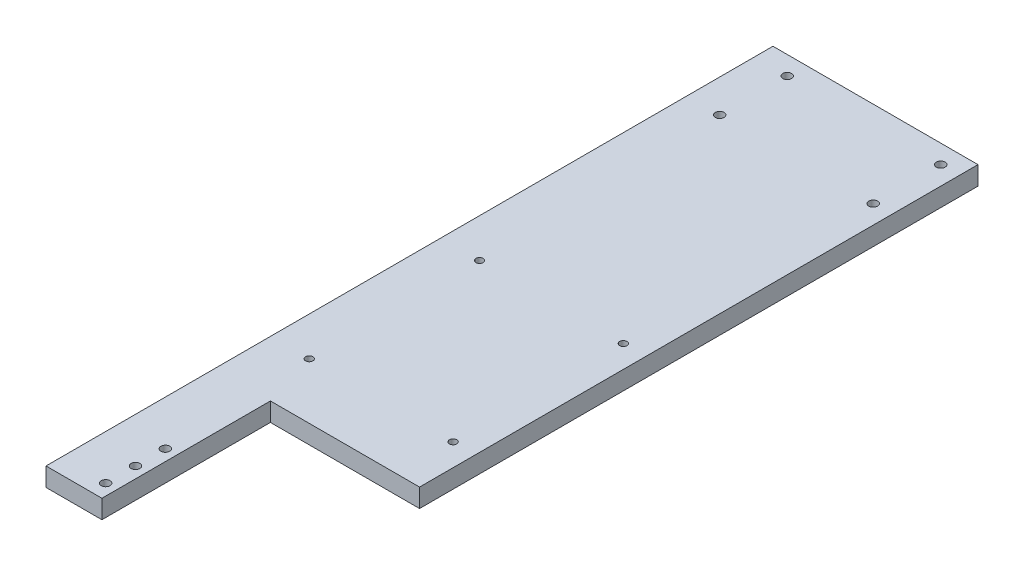
ISO-10303-21;
HEADER;
FILE_DESCRIPTION(('STEP AP214'),'2;1');
FILE_NAME('part.step','',(''),(''),'','','');
FILE_SCHEMA(('AUTOMOTIVE_DESIGN { 1 0 10303 214 1 1 1 1 }'));
ENDSEC;
DATA;
#1=APPLICATION_CONTEXT('core data for automotive mechanical design processes');
#2=APPLICATION_PROTOCOL_DEFINITION('international standard','automotive_design',2000,#1);
#3=PRODUCT_CONTEXT('',#1,'mechanical');
#4=PRODUCT('Part','Part','',(#3));
#5=PRODUCT_RELATED_PRODUCT_CATEGORY('part','',(#4));
#6=PRODUCT_DEFINITION_FORMATION('','',#4);
#7=PRODUCT_DEFINITION_CONTEXT('part definition',#1,'design');
#8=PRODUCT_DEFINITION('design','',#6,#7);
#9=PRODUCT_DEFINITION_SHAPE('','',#8);
#10=(LENGTH_UNIT() NAMED_UNIT(*) SI_UNIT(.MILLI.,.METRE.));
#11=(NAMED_UNIT(*) PLANE_ANGLE_UNIT() SI_UNIT($,.RADIAN.));
#12=(NAMED_UNIT(*) SI_UNIT($,.STERADIAN.) SOLID_ANGLE_UNIT());
#13=UNCERTAINTY_MEASURE_WITH_UNIT(LENGTH_MEASURE(1.E-05),#10,'distance_accuracy_value','');
#14=(GEOMETRIC_REPRESENTATION_CONTEXT(3) GLOBAL_UNCERTAINTY_ASSIGNED_CONTEXT((#13)) GLOBAL_UNIT_ASSIGNED_CONTEXT((#10,
#11,#12)) REPRESENTATION_CONTEXT('',''));
#15=CARTESIAN_POINT('',(0.,0.,0.));
#16=DIRECTION('',(0.,0.,1.));
#17=DIRECTION('',(1.,0.,0.));
#18=AXIS2_PLACEMENT_3D('',#15,#16,#17);
#19=CARTESIAN_POINT('',(0.,6.35,0.));
#20=DIRECTION('',(1.,0.,0.));
#21=DIRECTION('',(0.,0.,-1.));
#22=AXIS2_PLACEMENT_3D('',#19,#20,#21);
#23=PLANE('',#22);
#24=DIRECTION('',(0.,0.,1.));
#25=VECTOR('',#24,1.);
#26=CARTESIAN_POINT('',(0.,0.,0.));
#27=LINE('',#26,#25);
#28=CARTESIAN_POINT('',(0.,0.,-247.65));
#29=VERTEX_POINT('',#28);
#30=CARTESIAN_POINT('',(0.,0.,0.));
#31=VERTEX_POINT('',#30);
#32=EDGE_CURVE('E119',#29,#31,#27,.T.);
#33=ORIENTED_EDGE('',*,*,#32,.T.);
#34=DIRECTION('',(0.,-1.,0.));
#35=VECTOR('',#34,1.);
#36=CARTESIAN_POINT('',(0.,6.35,0.));
#37=LINE('',#36,#35);
#38=CARTESIAN_POINT('',(0.,6.35,0.));
#39=VERTEX_POINT('',#38);
#40=EDGE_CURVE('E11',#39,#31,#37,.T.);
#41=ORIENTED_EDGE('',*,*,#40,.F.);
#42=DIRECTION('',(0.,0.,1.));
#43=VECTOR('',#42,1.);
#44=CARTESIAN_POINT('',(0.,6.35,0.));
#45=LINE('',#44,#43);
#46=CARTESIAN_POINT('',(0.,6.35,-247.65));
#47=VERTEX_POINT('',#46);
#48=EDGE_CURVE('E116',#47,#39,#45,.T.);
#49=ORIENTED_EDGE('',*,*,#48,.F.);
#50=DIRECTION('',(0.,-1.,0.));
#51=VECTOR('',#50,1.);
#52=CARTESIAN_POINT('',(0.,6.35,-247.65));
#53=LINE('',#52,#51);
#54=EDGE_CURVE('E123',#47,#29,#53,.T.);
#55=ORIENTED_EDGE('',*,*,#54,.T.);
#56=EDGE_LOOP('',(#33,#41,#49,#55));
#57=FACE_BOUND('',#56,.T.);
#58=ADVANCED_FACE('F33',(#57),#23,.F.);
#59=CARTESIAN_POINT('',(0.,6.35,0.));
#60=DIRECTION('',(0.,0.,-1.));
#61=DIRECTION('',(-1.,0.,0.));
#62=AXIS2_PLACEMENT_3D('',#59,#60,#61);
#63=PLANE('',#62);
#64=DIRECTION('',(1.,0.,0.));
#65=VECTOR('',#64,1.);
#66=CARTESIAN_POINT('',(0.,0.,0.));
#67=LINE('',#66,#65);
#68=CARTESIAN_POINT('',(19.05,0.,0.));
#69=VERTEX_POINT('',#68);
#70=EDGE_CURVE('E114',#31,#69,#67,.T.);
#71=ORIENTED_EDGE('',*,*,#70,.T.);
#72=DIRECTION('',(0.,1.,0.));
#73=VECTOR('',#72,1.);
#74=CARTESIAN_POINT('',(19.05,0.,0.));
#75=LINE('',#74,#73);
#76=CARTESIAN_POINT('',(19.05,6.35,0.));
#77=VERTEX_POINT('',#76);
#78=EDGE_CURVE('E130',#69,#77,#75,.T.);
#79=ORIENTED_EDGE('',*,*,#78,.T.);
#80=DIRECTION('',(1.,0.,0.));
#81=VECTOR('',#80,1.);
#82=CARTESIAN_POINT('',(0.,6.35,0.));
#83=LINE('',#82,#81);
#84=EDGE_CURVE('E79',#39,#77,#83,.T.);
#85=ORIENTED_EDGE('',*,*,#84,.F.);
#86=ORIENTED_EDGE('',*,*,#40,.T.);
#87=EDGE_LOOP('',(#71,#79,#85,#86));
#88=FACE_BOUND('',#87,.T.);
#89=ADVANCED_FACE('F140',(#88),#63,.F.);
#90=CARTESIAN_POINT('',(69.85,6.35,0.));
#91=DIRECTION('',(-1.,0.,0.));
#92=DIRECTION('',(0.,0.,1.));
#93=AXIS2_PLACEMENT_3D('',#90,#91,#92);
#94=PLANE('',#93);
#95=DIRECTION('',(0.,0.,-1.));
#96=VECTOR('',#95,1.);
#97=CARTESIAN_POINT('',(69.85,6.35,0.));
#98=LINE('',#97,#96);
#99=CARTESIAN_POINT('',(69.85,6.35,-57.404));
#100=VERTEX_POINT('',#99);
#101=CARTESIAN_POINT('',(69.85,6.35,-247.65));
#102=VERTEX_POINT('',#101);
#103=EDGE_CURVE('E110',#100,#102,#98,.T.);
#104=ORIENTED_EDGE('',*,*,#103,.F.);
#105=DIRECTION('',(0.,1.,0.));
#106=VECTOR('',#105,1.);
#107=CARTESIAN_POINT('',(69.85,0.,-57.404));
#108=LINE('',#107,#106);
#109=CARTESIAN_POINT('',(69.85,0.,-57.404));
#110=VERTEX_POINT('',#109);
#111=EDGE_CURVE('E98',#110,#100,#108,.T.);
#112=ORIENTED_EDGE('',*,*,#111,.F.);
#113=DIRECTION('',(0.,0.,-1.));
#114=VECTOR('',#113,1.);
#115=CARTESIAN_POINT('',(69.85,0.,0.));
#116=LINE('',#115,#114);
#117=CARTESIAN_POINT('',(69.85,0.,-247.65));
#118=VERTEX_POINT('',#117);
#119=EDGE_CURVE('E109',#110,#118,#116,.T.);
#120=ORIENTED_EDGE('',*,*,#119,.T.);
#121=DIRECTION('',(0.,-1.,0.));
#122=VECTOR('',#121,1.);
#123=CARTESIAN_POINT('',(69.85,6.35,-247.65));
#124=LINE('',#123,#122);
#125=EDGE_CURVE('E40',#102,#118,#124,.T.);
#126=ORIENTED_EDGE('',*,*,#125,.F.);
#127=EDGE_LOOP('',(#104,#112,#120,#126));
#128=FACE_BOUND('',#127,.T.);
#129=ADVANCED_FACE('F107',(#128),#94,.F.);
#130=CARTESIAN_POINT('',(0.,6.35,-247.65));
#131=DIRECTION('',(0.,0.,1.));
#132=DIRECTION('',(1.,0.,0.));
#133=AXIS2_PLACEMENT_3D('',#130,#131,#132);
#134=PLANE('',#133);
#135=DIRECTION('',(-1.,0.,0.));
#136=VECTOR('',#135,1.);
#137=CARTESIAN_POINT('',(0.,0.,-247.65));
#138=LINE('',#137,#136);
#139=EDGE_CURVE('E73',#118,#29,#138,.T.);
#140=ORIENTED_EDGE('',*,*,#139,.T.);
#141=ORIENTED_EDGE('',*,*,#54,.F.);
#142=DIRECTION('',(-1.,0.,0.));
#143=VECTOR('',#142,1.);
#144=CARTESIAN_POINT('',(0.,6.35,-247.65));
#145=LINE('',#144,#143);
#146=EDGE_CURVE('E56',#102,#47,#145,.T.);
#147=ORIENTED_EDGE('',*,*,#146,.F.);
#148=ORIENTED_EDGE('',*,*,#125,.T.);
#149=EDGE_LOOP('',(#140,#141,#147,#148));
#150=FACE_BOUND('',#149,.T.);
#151=ADVANCED_FACE('F124',(#150),#134,.F.);
#152=CARTESIAN_POINT('',(0.,6.35,0.));
#153=DIRECTION('',(0.,-1.,0.));
#154=DIRECTION('',(0.,0.,-1.));
#155=AXIS2_PLACEMENT_3D('',#152,#153,#154);
#156=PLANE('',#155);
#157=CARTESIAN_POINT('',(13.23,6.35,-134.454));
#158=DIRECTION('',(0.,1.,0.));
#159=DIRECTION('',(0.,0.,1.));
#160=AXIS2_PLACEMENT_3D('',#157,#158,#159);
#161=CIRCLE('',#160,1.25);
#162=CARTESIAN_POINT('',(13.23,6.35,-133.204));
#163=VERTEX_POINT('',#162);
#164=EDGE_CURVE('E206',#163,#163,#161,.T.);
#165=ORIENTED_EDGE('',*,*,#164,.F.);
#166=EDGE_LOOP('',(#165));
#167=FACE_BOUND('',#166,.T.);
#168=CARTESIAN_POINT('',(62.23,6.35,-76.454));
#169=DIRECTION('',(0.,1.,0.));
#170=DIRECTION('',(0.,0.,1.));
#171=AXIS2_PLACEMENT_3D('',#168,#169,#170);
#172=CIRCLE('',#171,1.24999999999999);
#173=CARTESIAN_POINT('',(62.23,6.35,-75.204));
#174=VERTEX_POINT('',#173);
#175=EDGE_CURVE('E199',#174,#174,#172,.T.);
#176=ORIENTED_EDGE('',*,*,#175,.F.);
#177=EDGE_LOOP('',(#176));
#178=FACE_BOUND('',#177,.T.);
#179=CARTESIAN_POINT('',(13.23,6.35,-76.454));
#180=DIRECTION('',(0.,1.,0.));
#181=DIRECTION('',(0.,0.,1.));
#182=AXIS2_PLACEMENT_3D('',#179,#180,#181);
#183=CIRCLE('',#182,1.25);
#184=CARTESIAN_POINT('',(13.23,6.35,-75.204));
#185=VERTEX_POINT('',#184);
#186=EDGE_CURVE('E211',#185,#185,#183,.T.);
#187=ORIENTED_EDGE('',*,*,#186,.F.);
#188=EDGE_LOOP('',(#187));
#189=FACE_BOUND('',#188,.T.);
#190=CARTESIAN_POINT('',(62.23,6.35,-134.454));
#191=DIRECTION('',(0.,1.,0.));
#192=DIRECTION('',(0.,0.,1.));
#193=AXIS2_PLACEMENT_3D('',#190,#191,#192);
#194=CIRCLE('',#193,1.24999999999999);
#195=CARTESIAN_POINT('',(62.23,6.35,-133.204));
#196=VERTEX_POINT('',#195);
#197=EDGE_CURVE('E193',#196,#196,#194,.T.);
#198=ORIENTED_EDGE('',*,*,#197,.F.);
#199=EDGE_LOOP('',(#198));
#200=FACE_BOUND('',#199,.T.);
#201=CARTESIAN_POINT('',(11.2,6.35,-241.3));
#202=DIRECTION('',(0.,1.,0.));
#203=DIRECTION('',(0.,0.,1.));
#204=AXIS2_PLACEMENT_3D('',#201,#202,#203);
#205=CIRCLE('',#204,1.499997);
#206=CARTESIAN_POINT('',(11.2,6.35,-239.800003));
#207=VERTEX_POINT('',#206);
#208=EDGE_CURVE('E175',#207,#207,#205,.T.);
#209=ORIENTED_EDGE('',*,*,#208,.F.);
#210=EDGE_LOOP('',(#209));
#211=FACE_BOUND('',#210,.T.);
#212=CARTESIAN_POINT('',(11.2,6.35,-218.3));
#213=DIRECTION('',(0.,1.,0.));
#214=DIRECTION('',(0.,0.,1.));
#215=AXIS2_PLACEMENT_3D('',#212,#213,#214);
#216=CIRCLE('',#215,1.499997);
#217=CARTESIAN_POINT('',(11.2,6.35,-216.800003));
#218=VERTEX_POINT('',#217);
#219=EDGE_CURVE('E182',#218,#218,#216,.T.);
#220=ORIENTED_EDGE('',*,*,#219,.F.);
#221=EDGE_LOOP('',(#220));
#222=FACE_BOUND('',#221,.T.);
#223=CARTESIAN_POINT('',(63.5,6.35,-218.3));
#224=DIRECTION('',(0.,1.,0.));
#225=DIRECTION('',(0.,0.,1.));
#226=AXIS2_PLACEMENT_3D('',#223,#224,#225);
#227=CIRCLE('',#226,1.49999700000001);
#228=CARTESIAN_POINT('',(63.5,6.35,-216.800003));
#229=VERTEX_POINT('',#228);
#230=EDGE_CURVE('E188',#229,#229,#227,.T.);
#231=ORIENTED_EDGE('',*,*,#230,.F.);
#232=EDGE_LOOP('',(#231));
#233=FACE_BOUND('',#232,.T.);
#234=CARTESIAN_POINT('',(63.5,6.35,-241.3));
#235=DIRECTION('',(0.,1.,0.));
#236=DIRECTION('',(0.,0.,1.));
#237=AXIS2_PLACEMENT_3D('',#234,#235,#236);
#238=CIRCLE('',#237,1.49999700000001);
#239=CARTESIAN_POINT('',(63.5,6.35,-239.800003));
#240=VERTEX_POINT('',#239);
#241=EDGE_CURVE('E154',#240,#240,#238,.T.);
#242=ORIENTED_EDGE('',*,*,#241,.F.);
#243=EDGE_LOOP('',(#242));
#244=FACE_BOUND('',#243,.T.);
#245=CARTESIAN_POINT('',(15.24,6.35,-5.08));
#246=DIRECTION('',(0.,1.,0.));
#247=DIRECTION('',(0.,0.,1.));
#248=AXIS2_PLACEMENT_3D('',#245,#246,#247);
#249=CIRCLE('',#248,1.499997);
#250=CARTESIAN_POINT('',(15.24,6.35,-3.580003));
#251=VERTEX_POINT('',#250);
#252=EDGE_CURVE('E146',#251,#251,#249,.T.);
#253=ORIENTED_EDGE('',*,*,#252,.F.);
#254=EDGE_LOOP('',(#253));
#255=FACE_BOUND('',#254,.T.);
#256=CARTESIAN_POINT('',(15.24,6.35,-25.4));
#257=DIRECTION('',(0.,1.,0.));
#258=DIRECTION('',(0.,0.,1.));
#259=AXIS2_PLACEMENT_3D('',#256,#257,#258);
#260=CIRCLE('',#259,1.499997);
#261=CARTESIAN_POINT('',(15.24,6.35,-23.900003));
#262=VERTEX_POINT('',#261);
#263=EDGE_CURVE('E159',#262,#262,#260,.T.);
#264=ORIENTED_EDGE('',*,*,#263,.F.);
#265=EDGE_LOOP('',(#264));
#266=FACE_BOUND('',#265,.T.);
#267=CARTESIAN_POINT('',(15.24,6.35,-15.24));
#268=DIRECTION('',(0.,1.,0.));
#269=DIRECTION('',(0.,0.,1.));
#270=AXIS2_PLACEMENT_3D('',#267,#268,#269);
#271=CIRCLE('',#270,1.499997);
#272=CARTESIAN_POINT('',(15.24,6.35,-13.740003));
#273=VERTEX_POINT('',#272);
#274=EDGE_CURVE('E164',#273,#273,#271,.T.);
#275=ORIENTED_EDGE('',*,*,#274,.F.);
#276=EDGE_LOOP('',(#275));
#277=FACE_BOUND('',#276,.T.);
#278=ORIENTED_EDGE('',*,*,#84,.T.);
#279=DIRECTION('',(0.,0.,1.));
#280=VECTOR('',#279,1.);
#281=CARTESIAN_POINT('',(19.05,6.35,0.));
#282=LINE('',#281,#280);
#283=CARTESIAN_POINT('',(19.05,6.35,-57.404));
#284=VERTEX_POINT('',#283);
#285=EDGE_CURVE('E103',#284,#77,#282,.T.);
#286=ORIENTED_EDGE('',*,*,#285,.F.);
#287=DIRECTION('',(-1.,0.,0.));
#288=VECTOR('',#287,1.);
#289=CARTESIAN_POINT('',(69.85,6.35,-57.404));
#290=LINE('',#289,#288);
#291=EDGE_CURVE('E143',#100,#284,#290,.T.);
#292=ORIENTED_EDGE('',*,*,#291,.F.);
#293=ORIENTED_EDGE('',*,*,#103,.T.);
#294=ORIENTED_EDGE('',*,*,#146,.T.);
#295=ORIENTED_EDGE('',*,*,#48,.T.);
#296=EDGE_LOOP('',(#278,#286,#292,#293,#294,#295));
#297=FACE_BOUND('',#296,.T.);
#298=ADVANCED_FACE('F139',(#167,#178,#189,#200,#211,#222,#233,#244,#255,#266,#277,#297),#156,.F.);
#299=CARTESIAN_POINT('',(0.,0.,0.));
#300=DIRECTION('',(0.,-1.,0.));
#301=DIRECTION('',(0.,0.,-1.));
#302=AXIS2_PLACEMENT_3D('',#299,#300,#301);
#303=PLANE('',#302);
#304=CARTESIAN_POINT('',(13.23,0.,-134.454));
#305=DIRECTION('',(0.,1.,0.));
#306=DIRECTION('',(0.,0.,1.));
#307=AXIS2_PLACEMENT_3D('',#304,#305,#306);
#308=CIRCLE('',#307,1.25);
#309=CARTESIAN_POINT('',(13.23,0.,-133.204));
#310=VERTEX_POINT('',#309);
#311=EDGE_CURVE('E196',#310,#310,#308,.T.);
#312=ORIENTED_EDGE('',*,*,#311,.T.);
#313=EDGE_LOOP('',(#312));
#314=FACE_BOUND('',#313,.T.);
#315=CARTESIAN_POINT('',(62.23,0.,-76.454));
#316=DIRECTION('',(0.,1.,0.));
#317=DIRECTION('',(0.,0.,1.));
#318=AXIS2_PLACEMENT_3D('',#315,#316,#317);
#319=CIRCLE('',#318,1.24999999999999);
#320=CARTESIAN_POINT('',(62.23,0.,-75.204));
#321=VERTEX_POINT('',#320);
#322=EDGE_CURVE('E202',#321,#321,#319,.T.);
#323=ORIENTED_EDGE('',*,*,#322,.T.);
#324=EDGE_LOOP('',(#323));
#325=FACE_BOUND('',#324,.T.);
#326=CARTESIAN_POINT('',(13.23,0.,-76.454));
#327=DIRECTION('',(0.,1.,0.));
#328=DIRECTION('',(0.,0.,1.));
#329=AXIS2_PLACEMENT_3D('',#326,#327,#328);
#330=CIRCLE('',#329,1.25);
#331=CARTESIAN_POINT('',(13.23,0.,-75.204));
#332=VERTEX_POINT('',#331);
#333=EDGE_CURVE('E203',#332,#332,#330,.T.);
#334=ORIENTED_EDGE('',*,*,#333,.T.);
#335=EDGE_LOOP('',(#334));
#336=FACE_BOUND('',#335,.T.);
#337=CARTESIAN_POINT('',(62.23,0.,-134.454));
#338=DIRECTION('',(0.,1.,0.));
#339=DIRECTION('',(0.,0.,1.));
#340=AXIS2_PLACEMENT_3D('',#337,#338,#339);
#341=CIRCLE('',#340,1.24999999999999);
#342=CARTESIAN_POINT('',(62.23,0.,-133.204));
#343=VERTEX_POINT('',#342);
#344=EDGE_CURVE('E179',#343,#343,#341,.T.);
#345=ORIENTED_EDGE('',*,*,#344,.T.);
#346=EDGE_LOOP('',(#345));
#347=FACE_BOUND('',#346,.T.);
#348=CARTESIAN_POINT('',(11.2,0.,-241.3));
#349=DIRECTION('',(0.,1.,0.));
#350=DIRECTION('',(0.,0.,1.));
#351=AXIS2_PLACEMENT_3D('',#348,#349,#350);
#352=CIRCLE('',#351,1.499997);
#353=CARTESIAN_POINT('',(11.2,0.,-239.800003));
#354=VERTEX_POINT('',#353);
#355=EDGE_CURVE('E178',#354,#354,#352,.T.);
#356=ORIENTED_EDGE('',*,*,#355,.T.);
#357=EDGE_LOOP('',(#356));
#358=FACE_BOUND('',#357,.T.);
#359=CARTESIAN_POINT('',(11.2,0.,-218.3));
#360=DIRECTION('',(0.,1.,0.));
#361=DIRECTION('',(0.,0.,1.));
#362=AXIS2_PLACEMENT_3D('',#359,#360,#361);
#363=CIRCLE('',#362,1.499997);
#364=CARTESIAN_POINT('',(11.2,0.,-216.800003));
#365=VERTEX_POINT('',#364);
#366=EDGE_CURVE('E185',#365,#365,#363,.T.);
#367=ORIENTED_EDGE('',*,*,#366,.T.);
#368=EDGE_LOOP('',(#367));
#369=FACE_BOUND('',#368,.T.);
#370=CARTESIAN_POINT('',(63.5,0.,-218.3));
#371=DIRECTION('',(0.,1.,0.));
#372=DIRECTION('',(0.,0.,1.));
#373=AXIS2_PLACEMENT_3D('',#370,#371,#372);
#374=CIRCLE('',#373,1.49999700000001);
#375=CARTESIAN_POINT('',(63.5,0.,-216.800003));
#376=VERTEX_POINT('',#375);
#377=EDGE_CURVE('E173',#376,#376,#374,.T.);
#378=ORIENTED_EDGE('',*,*,#377,.T.);
#379=EDGE_LOOP('',(#378));
#380=FACE_BOUND('',#379,.T.);
#381=CARTESIAN_POINT('',(63.5,0.,-241.3));
#382=DIRECTION('',(0.,1.,0.));
#383=DIRECTION('',(0.,0.,1.));
#384=AXIS2_PLACEMENT_3D('',#381,#382,#383);
#385=CIRCLE('',#384,1.49999700000001);
#386=CARTESIAN_POINT('',(63.5,0.,-239.800003));
#387=VERTEX_POINT('',#386);
#388=EDGE_CURVE('E166',#387,#387,#385,.T.);
#389=ORIENTED_EDGE('',*,*,#388,.T.);
#390=EDGE_LOOP('',(#389));
#391=FACE_BOUND('',#390,.T.);
#392=CARTESIAN_POINT('',(15.24,0.,-5.08));
#393=DIRECTION('',(0.,1.,0.));
#394=DIRECTION('',(0.,0.,1.));
#395=AXIS2_PLACEMENT_3D('',#392,#393,#394);
#396=CIRCLE('',#395,1.499997);
#397=CARTESIAN_POINT('',(15.24,0.,-3.580003));
#398=VERTEX_POINT('',#397);
#399=EDGE_CURVE('E144',#398,#398,#396,.T.);
#400=ORIENTED_EDGE('',*,*,#399,.T.);
#401=EDGE_LOOP('',(#400));
#402=FACE_BOUND('',#401,.T.);
#403=CARTESIAN_POINT('',(15.24,0.,-25.4));
#404=DIRECTION('',(0.,1.,0.));
#405=DIRECTION('',(0.,0.,1.));
#406=AXIS2_PLACEMENT_3D('',#403,#404,#405);
#407=CIRCLE('',#406,1.499997);
#408=CARTESIAN_POINT('',(15.24,0.,-23.900003));
#409=VERTEX_POINT('',#408);
#410=EDGE_CURVE('E151',#409,#409,#407,.T.);
#411=ORIENTED_EDGE('',*,*,#410,.T.);
#412=EDGE_LOOP('',(#411));
#413=FACE_BOUND('',#412,.T.);
#414=CARTESIAN_POINT('',(15.24,0.,-15.24));
#415=DIRECTION('',(0.,1.,0.));
#416=DIRECTION('',(0.,0.,1.));
#417=AXIS2_PLACEMENT_3D('',#414,#415,#416);
#418=CIRCLE('',#417,1.499997);
#419=CARTESIAN_POINT('',(15.24,0.,-13.740003));
#420=VERTEX_POINT('',#419);
#421=EDGE_CURVE('E162',#420,#420,#418,.T.);
#422=ORIENTED_EDGE('',*,*,#421,.T.);
#423=EDGE_LOOP('',(#422));
#424=FACE_BOUND('',#423,.T.);
#425=DIRECTION('',(0.,0.,1.));
#426=VECTOR('',#425,1.);
#427=CARTESIAN_POINT('',(19.05,0.,0.));
#428=LINE('',#427,#426);
#429=CARTESIAN_POINT('',(19.05,0.,-57.404));
#430=VERTEX_POINT('',#429);
#431=EDGE_CURVE('E47',#430,#69,#428,.T.);
#432=ORIENTED_EDGE('',*,*,#431,.T.);
#433=ORIENTED_EDGE('',*,*,#70,.F.);
#434=ORIENTED_EDGE('',*,*,#32,.F.);
#435=ORIENTED_EDGE('',*,*,#139,.F.);
#436=ORIENTED_EDGE('',*,*,#119,.F.);
#437=DIRECTION('',(-1.,0.,0.));
#438=VECTOR('',#437,1.);
#439=CARTESIAN_POINT('',(69.85,0.,-57.404));
#440=LINE('',#439,#438);
#441=EDGE_CURVE('E94',#110,#430,#440,.T.);
#442=ORIENTED_EDGE('',*,*,#441,.T.);
#443=EDGE_LOOP('',(#432,#433,#434,#435,#436,#442));
#444=FACE_BOUND('',#443,.T.);
#445=ADVANCED_FACE('F112',(#314,#325,#336,#347,#358,#369,#380,#391,#402,#413,#424,#444),#303,.T.);
#446=CARTESIAN_POINT('',(19.05,0.,0.));
#447=DIRECTION('',(-1.,0.,0.));
#448=DIRECTION('',(0.,0.,1.));
#449=AXIS2_PLACEMENT_3D('',#446,#447,#448);
#450=PLANE('',#449);
#451=ORIENTED_EDGE('',*,*,#285,.T.);
#452=ORIENTED_EDGE('',*,*,#78,.F.);
#453=ORIENTED_EDGE('',*,*,#431,.F.);
#454=DIRECTION('',(0.,1.,0.));
#455=VECTOR('',#454,1.);
#456=CARTESIAN_POINT('',(19.05,0.,-57.404));
#457=LINE('',#456,#455);
#458=EDGE_CURVE('E100',#430,#284,#457,.T.);
#459=ORIENTED_EDGE('',*,*,#458,.T.);
#460=EDGE_LOOP('',(#451,#452,#453,#459));
#461=FACE_BOUND('',#460,.T.);
#462=ADVANCED_FACE('F274',(#461),#450,.F.);
#463=CARTESIAN_POINT('',(69.85,0.,-57.404));
#464=DIRECTION('',(0.,0.,-1.));
#465=DIRECTION('',(-1.,0.,0.));
#466=AXIS2_PLACEMENT_3D('',#463,#464,#465);
#467=PLANE('',#466);
#468=ORIENTED_EDGE('',*,*,#291,.T.);
#469=ORIENTED_EDGE('',*,*,#458,.F.);
#470=ORIENTED_EDGE('',*,*,#441,.F.);
#471=ORIENTED_EDGE('',*,*,#111,.T.);
#472=EDGE_LOOP('',(#468,#469,#470,#471));
#473=FACE_BOUND('',#472,.T.);
#474=ADVANCED_FACE('F97',(#473),#467,.F.);
#475=CARTESIAN_POINT('',(15.24,0.,-15.24));
#476=DIRECTION('',(0.,1.,0.));
#477=DIRECTION('',(0.,0.,1.));
#478=AXIS2_PLACEMENT_3D('',#475,#476,#477);
#479=CYLINDRICAL_SURFACE('',#478,1.499997);
#480=ORIENTED_EDGE('',*,*,#421,.F.);
#481=EDGE_LOOP('',(#480));
#482=FACE_BOUND('',#481,.T.);
#483=ORIENTED_EDGE('',*,*,#274,.T.);
#484=EDGE_LOOP('',(#483));
#485=FACE_BOUND('',#484,.T.);
#486=ADVANCED_FACE('F249',(#482,#485),#479,.F.);
#487=CARTESIAN_POINT('',(15.24,0.,-25.4));
#488=DIRECTION('',(0.,1.,0.));
#489=DIRECTION('',(0.,0.,1.));
#490=AXIS2_PLACEMENT_3D('',#487,#488,#489);
#491=CYLINDRICAL_SURFACE('',#490,1.499997);
#492=ORIENTED_EDGE('',*,*,#410,.F.);
#493=EDGE_LOOP('',(#492));
#494=FACE_BOUND('',#493,.T.);
#495=ORIENTED_EDGE('',*,*,#263,.T.);
#496=EDGE_LOOP('',(#495));
#497=FACE_BOUND('',#496,.T.);
#498=ADVANCED_FACE('F246',(#494,#497),#491,.F.);
#499=CARTESIAN_POINT('',(15.24,0.,-5.08));
#500=DIRECTION('',(0.,1.,0.));
#501=DIRECTION('',(0.,0.,1.));
#502=AXIS2_PLACEMENT_3D('',#499,#500,#501);
#503=CYLINDRICAL_SURFACE('',#502,1.499997);
#504=ORIENTED_EDGE('',*,*,#399,.F.);
#505=EDGE_LOOP('',(#504));
#506=FACE_BOUND('',#505,.T.);
#507=ORIENTED_EDGE('',*,*,#252,.T.);
#508=EDGE_LOOP('',(#507));
#509=FACE_BOUND('',#508,.T.);
#510=ADVANCED_FACE('F248',(#506,#509),#503,.F.);
#511=CARTESIAN_POINT('',(63.5,0.,-241.3));
#512=DIRECTION('',(0.,1.,0.));
#513=DIRECTION('',(0.,0.,1.));
#514=AXIS2_PLACEMENT_3D('',#511,#512,#513);
#515=CYLINDRICAL_SURFACE('',#514,1.49999700000001);
#516=ORIENTED_EDGE('',*,*,#388,.F.);
#517=EDGE_LOOP('',(#516));
#518=FACE_BOUND('',#517,.T.);
#519=ORIENTED_EDGE('',*,*,#241,.T.);
#520=EDGE_LOOP('',(#519));
#521=FACE_BOUND('',#520,.T.);
#522=ADVANCED_FACE('F256',(#518,#521),#515,.F.);
#523=CARTESIAN_POINT('',(63.5,0.,-218.3));
#524=DIRECTION('',(0.,1.,0.));
#525=DIRECTION('',(0.,0.,1.));
#526=AXIS2_PLACEMENT_3D('',#523,#524,#525);
#527=CYLINDRICAL_SURFACE('',#526,1.49999700000001);
#528=ORIENTED_EDGE('',*,*,#377,.F.);
#529=EDGE_LOOP('',(#528));
#530=FACE_BOUND('',#529,.T.);
#531=ORIENTED_EDGE('',*,*,#230,.T.);
#532=EDGE_LOOP('',(#531));
#533=FACE_BOUND('',#532,.T.);
#534=ADVANCED_FACE('F312',(#530,#533),#527,.F.);
#535=CARTESIAN_POINT('',(11.2,0.,-218.3));
#536=DIRECTION('',(0.,1.,0.));
#537=DIRECTION('',(0.,0.,1.));
#538=AXIS2_PLACEMENT_3D('',#535,#536,#537);
#539=CYLINDRICAL_SURFACE('',#538,1.499997);
#540=ORIENTED_EDGE('',*,*,#366,.F.);
#541=EDGE_LOOP('',(#540));
#542=FACE_BOUND('',#541,.T.);
#543=ORIENTED_EDGE('',*,*,#219,.T.);
#544=EDGE_LOOP('',(#543));
#545=FACE_BOUND('',#544,.T.);
#546=ADVANCED_FACE('F322',(#542,#545),#539,.F.);
#547=CARTESIAN_POINT('',(11.2,0.,-241.3));
#548=DIRECTION('',(0.,1.,0.));
#549=DIRECTION('',(0.,0.,1.));
#550=AXIS2_PLACEMENT_3D('',#547,#548,#549);
#551=CYLINDRICAL_SURFACE('',#550,1.499997);
#552=ORIENTED_EDGE('',*,*,#355,.F.);
#553=EDGE_LOOP('',(#552));
#554=FACE_BOUND('',#553,.T.);
#555=ORIENTED_EDGE('',*,*,#208,.T.);
#556=EDGE_LOOP('',(#555));
#557=FACE_BOUND('',#556,.T.);
#558=ADVANCED_FACE('F332',(#554,#557),#551,.F.);
#559=CARTESIAN_POINT('',(62.23,0.,-134.454));
#560=DIRECTION('',(0.,1.,0.));
#561=DIRECTION('',(0.,0.,1.));
#562=AXIS2_PLACEMENT_3D('',#559,#560,#561);
#563=CYLINDRICAL_SURFACE('',#562,1.24999999999999);
#564=ORIENTED_EDGE('',*,*,#344,.F.);
#565=EDGE_LOOP('',(#564));
#566=FACE_BOUND('',#565,.T.);
#567=ORIENTED_EDGE('',*,*,#197,.T.);
#568=EDGE_LOOP('',(#567));
#569=FACE_BOUND('',#568,.T.);
#570=ADVANCED_FACE('F223',(#566,#569),#563,.F.);
#571=CARTESIAN_POINT('',(13.23,0.,-76.454));
#572=DIRECTION('',(0.,1.,0.));
#573=DIRECTION('',(0.,0.,1.));
#574=AXIS2_PLACEMENT_3D('',#571,#572,#573);
#575=CYLINDRICAL_SURFACE('',#574,1.25);
#576=ORIENTED_EDGE('',*,*,#333,.F.);
#577=EDGE_LOOP('',(#576));
#578=FACE_BOUND('',#577,.T.);
#579=ORIENTED_EDGE('',*,*,#186,.T.);
#580=EDGE_LOOP('',(#579));
#581=FACE_BOUND('',#580,.T.);
#582=ADVANCED_FACE('F219',(#578,#581),#575,.F.);
#583=CARTESIAN_POINT('',(62.23,0.,-76.454));
#584=DIRECTION('',(0.,1.,0.));
#585=DIRECTION('',(0.,0.,1.));
#586=AXIS2_PLACEMENT_3D('',#583,#584,#585);
#587=CYLINDRICAL_SURFACE('',#586,1.24999999999999);
#588=ORIENTED_EDGE('',*,*,#322,.F.);
#589=EDGE_LOOP('',(#588));
#590=FACE_BOUND('',#589,.T.);
#591=ORIENTED_EDGE('',*,*,#175,.T.);
#592=EDGE_LOOP('',(#591));
#593=FACE_BOUND('',#592,.T.);
#594=ADVANCED_FACE('F222',(#590,#593),#587,.F.);
#595=CARTESIAN_POINT('',(13.23,0.,-134.454));
#596=DIRECTION('',(0.,1.,0.));
#597=DIRECTION('',(0.,0.,1.));
#598=AXIS2_PLACEMENT_3D('',#595,#596,#597);
#599=CYLINDRICAL_SURFACE('',#598,1.25);
#600=ORIENTED_EDGE('',*,*,#311,.F.);
#601=EDGE_LOOP('',(#600));
#602=FACE_BOUND('',#601,.T.);
#603=ORIENTED_EDGE('',*,*,#164,.T.);
#604=EDGE_LOOP('',(#603));
#605=FACE_BOUND('',#604,.T.);
#606=ADVANCED_FACE('F377',(#602,#605),#599,.F.);
#607=CLOSED_SHELL('',(#58,#89,#129,#151,#298,#445,#462,#474,#486,#498,#510,#522,#534,#546,#558,
#570,#582,#594,#606));
#608=MANIFOLD_SOLID_BREP('B2',#607);
#609=ADVANCED_BREP_SHAPE_REPRESENTATION('',(#18,#608),#14);
#610=SHAPE_DEFINITION_REPRESENTATION(#9,#609);
ENDSEC;
END-ISO-10303-21;
